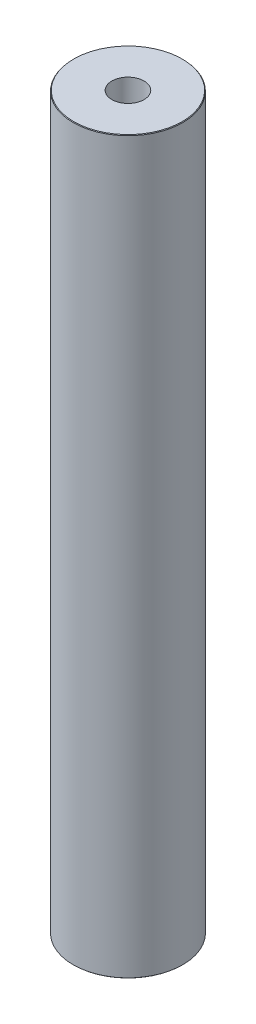
ISO-10303-21;
HEADER;
FILE_DESCRIPTION(('STEP AP214'),'2;1');
FILE_NAME('part.step','',(''),(''),'','','');
FILE_SCHEMA(('AUTOMOTIVE_DESIGN { 1 0 10303 214 1 1 1 1 }'));
ENDSEC;
DATA;
#1=APPLICATION_CONTEXT('core data for automotive mechanical design processes');
#2=APPLICATION_PROTOCOL_DEFINITION('international standard','automotive_design',2000,#1);
#3=PRODUCT_CONTEXT('',#1,'mechanical');
#4=PRODUCT('Part','Part','',(#3));
#5=PRODUCT_RELATED_PRODUCT_CATEGORY('part','',(#4));
#6=PRODUCT_DEFINITION_FORMATION('','',#4);
#7=PRODUCT_DEFINITION_CONTEXT('part definition',#1,'design');
#8=PRODUCT_DEFINITION('design','',#6,#7);
#9=PRODUCT_DEFINITION_SHAPE('','',#8);
#10=(LENGTH_UNIT() NAMED_UNIT(*) SI_UNIT(.MILLI.,.METRE.));
#11=(NAMED_UNIT(*) PLANE_ANGLE_UNIT() SI_UNIT($,.RADIAN.));
#12=(NAMED_UNIT(*) SI_UNIT($,.STERADIAN.) SOLID_ANGLE_UNIT());
#13=UNCERTAINTY_MEASURE_WITH_UNIT(LENGTH_MEASURE(1.E-05),#10,'distance_accuracy_value','');
#14=(GEOMETRIC_REPRESENTATION_CONTEXT(3) GLOBAL_UNCERTAINTY_ASSIGNED_CONTEXT((#13)) GLOBAL_UNIT_ASSIGNED_CONTEXT((#10,
#11,#12)) REPRESENTATION_CONTEXT('',''));
#15=CARTESIAN_POINT('',(0.,0.,0.));
#16=DIRECTION('',(0.,0.,1.));
#17=DIRECTION('',(1.,0.,0.));
#18=AXIS2_PLACEMENT_3D('',#15,#16,#17);
#19=CARTESIAN_POINT('',(0.,600.,0.));
#20=DIRECTION('',(0.,-1.,0.));
#21=DIRECTION('',(0.,0.,-1.));
#22=AXIS2_PLACEMENT_3D('',#19,#20,#21);
#23=CYLINDRICAL_SURFACE('',#22,45.);
#24=CARTESIAN_POINT('',(0.,599.498168945803,0.));
#25=DIRECTION('',(0.,1.,0.));
#26=DIRECTION('',(0.,0.,1.));
#27=AXIS2_PLACEMENT_3D('',#24,#25,#26);
#28=CIRCLE('',#27,45.);
#29=CARTESIAN_POINT('',(0.,599.498168945803,45.));
#30=VERTEX_POINT('',#29);
#31=EDGE_CURVE('E50',#30,#30,#28,.F.);
#32=ORIENTED_EDGE('',*,*,#31,.T.);
#33=EDGE_LOOP('',(#32));
#34=FACE_BOUND('',#33,.T.);
#35=CARTESIAN_POINT('',(0.,0.443721180196088,0.));
#36=DIRECTION('',(0.,1.,0.));
#37=DIRECTION('',(0.,0.,1.));
#38=AXIS2_PLACEMENT_3D('',#35,#36,#37);
#39=CIRCLE('',#38,45.);
#40=CARTESIAN_POINT('',(0.,0.443721180196088,45.));
#41=VERTEX_POINT('',#40);
#42=EDGE_CURVE('E51',#41,#41,#39,.T.);
#43=ORIENTED_EDGE('',*,*,#42,.T.);
#44=EDGE_LOOP('',(#43));
#45=FACE_BOUND('',#44,.T.);
#46=ADVANCED_FACE('F39',(#34,#45),#23,.T.);
#47=CARTESIAN_POINT('',(0.,600.,0.));
#48=DIRECTION('',(0.,1.,0.));
#49=DIRECTION('',(0.,0.,1.));
#50=AXIS2_PLACEMENT_3D('',#47,#48,#49);
#51=PLANE('',#50);
#52=CARTESIAN_POINT('',(0.,600.,0.));
#53=DIRECTION('',(0.,1.,0.));
#54=DIRECTION('',(0.,0.,1.));
#55=AXIS2_PLACEMENT_3D('',#52,#53,#54);
#56=CIRCLE('',#55,44.556278819804);
#57=CARTESIAN_POINT('',(0.,600.,44.556278819804));
#58=VERTEX_POINT('',#57);
#59=EDGE_CURVE('E54',#58,#58,#56,.T.);
#60=ORIENTED_EDGE('',*,*,#59,.T.);
#61=EDGE_LOOP('',(#60));
#62=FACE_BOUND('',#61,.T.);
#63=CARTESIAN_POINT('',(0.,600.,0.));
#64=DIRECTION('',(0.,1.,0.));
#65=DIRECTION('',(0.,0.,1.));
#66=AXIS2_PLACEMENT_3D('',#63,#64,#65);
#67=CIRCLE('',#66,13.2521430462489);
#68=CARTESIAN_POINT('',(0.,600.,13.2521430462489));
#69=VERTEX_POINT('',#68);
#70=EDGE_CURVE('E58',#69,#69,#67,.T.);
#71=ORIENTED_EDGE('',*,*,#70,.F.);
#72=EDGE_LOOP('',(#71));
#73=FACE_BOUND('',#72,.T.);
#74=ADVANCED_FACE('F69',(#62,#73),#51,.T.);
#75=CARTESIAN_POINT('',(0.,0.,0.));
#76=DIRECTION('',(0.,1.,0.));
#77=DIRECTION('',(0.,0.,1.));
#78=AXIS2_PLACEMENT_3D('',#75,#76,#77);
#79=PLANE('',#78);
#80=CARTESIAN_POINT('',(0.,0.,0.));
#81=DIRECTION('',(0.,1.,0.));
#82=DIRECTION('',(0.,0.,1.));
#83=AXIS2_PLACEMENT_3D('',#80,#81,#82);
#84=CIRCLE('',#83,44.4981689458028);
#85=CARTESIAN_POINT('',(0.,0.,44.4981689458028));
#86=VERTEX_POINT('',#85);
#87=EDGE_CURVE('E10',#86,#86,#84,.F.);
#88=ORIENTED_EDGE('',*,*,#87,.T.);
#89=EDGE_LOOP('',(#88));
#90=FACE_BOUND('',#89,.T.);
#91=CARTESIAN_POINT('',(0.,0.,0.));
#92=DIRECTION('',(0.,1.,0.));
#93=DIRECTION('',(0.,0.,1.));
#94=AXIS2_PLACEMENT_3D('',#91,#92,#93);
#95=CIRCLE('',#94,13.2521430462489);
#96=CARTESIAN_POINT('',(0.,0.,13.2521430462489));
#97=VERTEX_POINT('',#96);
#98=EDGE_CURVE('E63',#97,#97,#95,.T.);
#99=ORIENTED_EDGE('',*,*,#98,.T.);
#100=EDGE_LOOP('',(#99));
#101=FACE_BOUND('',#100,.T.);
#102=ADVANCED_FACE('F75',(#90,#101),#79,.F.);
#103=CARTESIAN_POINT('',(0.,600.,0.));
#104=DIRECTION('',(0.,-1.,0.));
#105=DIRECTION('',(0.,0.,-1.));
#106=AXIS2_PLACEMENT_3D('',#103,#104,#105);
#107=CYLINDRICAL_SURFACE('',#106,13.2521430462489);
#108=ORIENTED_EDGE('',*,*,#70,.T.);
#109=EDGE_LOOP('',(#108));
#110=FACE_BOUND('',#109,.T.);
#111=ORIENTED_EDGE('',*,*,#98,.F.);
#112=EDGE_LOOP('',(#111));
#113=FACE_BOUND('',#112,.T.);
#114=ADVANCED_FACE('F70',(#110,#113),#107,.F.);
#115=CARTESIAN_POINT('',(0.,600.,0.));
#116=DIRECTION('',(0.,-1.,0.));
#117=DIRECTION('',(0.,0.,-1.));
#118=AXIS2_PLACEMENT_3D('',#115,#116,#117);
#119=CONICAL_SURFACE('',#118,44.556278819804,0.724019341630382);
#120=ORIENTED_EDGE('',*,*,#31,.F.);
#121=EDGE_LOOP('',(#120));
#122=FACE_BOUND('',#121,.T.);
#123=ORIENTED_EDGE('',*,*,#59,.F.);
#124=EDGE_LOOP('',(#123));
#125=FACE_BOUND('',#124,.T.);
#126=ADVANCED_FACE('F81',(#122,#125),#119,.T.);
#127=CARTESIAN_POINT('',(0.,0.443721180196088,0.));
#128=DIRECTION('',(0.,1.,0.));
#129=DIRECTION('',(0.,0.,1.));
#130=AXIS2_PLACEMENT_3D('',#127,#128,#129);
#131=CONICAL_SURFACE('',#130,45.,0.846776985164543);
#132=ORIENTED_EDGE('',*,*,#87,.F.);
#133=EDGE_LOOP('',(#132));
#134=FACE_BOUND('',#133,.T.);
#135=ORIENTED_EDGE('',*,*,#42,.F.);
#136=EDGE_LOOP('',(#135));
#137=FACE_BOUND('',#136,.T.);
#138=ADVANCED_FACE('F45',(#134,#137),#131,.T.);
#139=CLOSED_SHELL('',(#46,#74,#102,#114,#126,#138));
#140=MANIFOLD_SOLID_BREP('B2',#139);
#141=ADVANCED_BREP_SHAPE_REPRESENTATION('',(#18,#140),#14);
#142=SHAPE_DEFINITION_REPRESENTATION(#9,#141);
ENDSEC;
END-ISO-10303-21;
